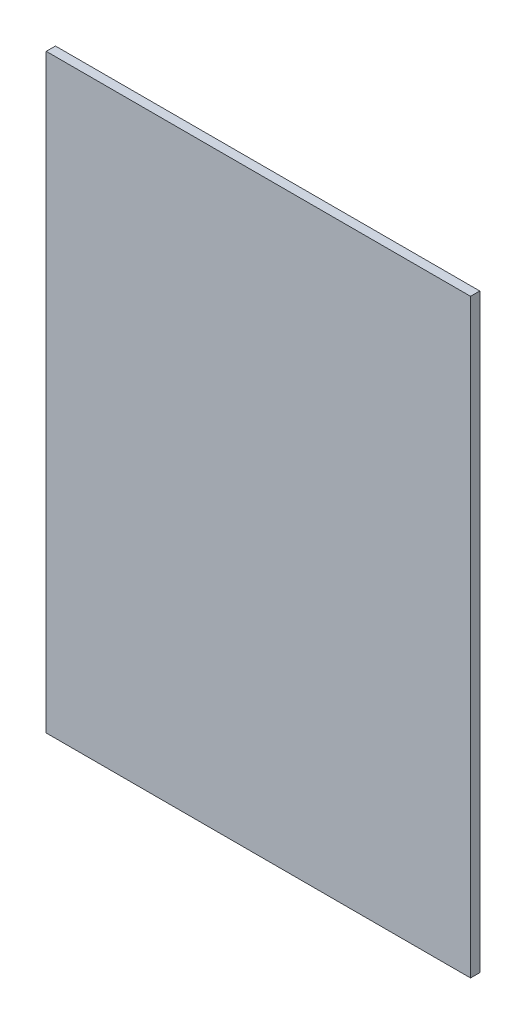
ISO-10303-21;
HEADER;
FILE_DESCRIPTION(('STEP AP214'),'2;1');
FILE_NAME('part.step','',(''),(''),'','','');
FILE_SCHEMA(('AUTOMOTIVE_DESIGN { 1 0 10303 214 1 1 1 1 }'));
ENDSEC;
DATA;
#1=APPLICATION_CONTEXT('core data for automotive mechanical design processes');
#2=APPLICATION_PROTOCOL_DEFINITION('international standard','automotive_design',2000,#1);
#3=PRODUCT_CONTEXT('',#1,'mechanical');
#4=PRODUCT('Part','Part','',(#3));
#5=PRODUCT_RELATED_PRODUCT_CATEGORY('part','',(#4));
#6=PRODUCT_DEFINITION_FORMATION('','',#4);
#7=PRODUCT_DEFINITION_CONTEXT('part definition',#1,'design');
#8=PRODUCT_DEFINITION('design','',#6,#7);
#9=PRODUCT_DEFINITION_SHAPE('','',#8);
#10=(LENGTH_UNIT() NAMED_UNIT(*) SI_UNIT(.MILLI.,.METRE.));
#11=(NAMED_UNIT(*) PLANE_ANGLE_UNIT() SI_UNIT($,.RADIAN.));
#12=(NAMED_UNIT(*) SI_UNIT($,.STERADIAN.) SOLID_ANGLE_UNIT());
#13=UNCERTAINTY_MEASURE_WITH_UNIT(LENGTH_MEASURE(1.E-05),#10,'distance_accuracy_value','');
#14=(GEOMETRIC_REPRESENTATION_CONTEXT(3) GLOBAL_UNCERTAINTY_ASSIGNED_CONTEXT((#13)) GLOBAL_UNIT_ASSIGNED_CONTEXT((#10,
#11,#12)) REPRESENTATION_CONTEXT('',''));
#15=CARTESIAN_POINT('',(0.,0.,0.));
#16=DIRECTION('',(0.,0.,1.));
#17=DIRECTION('',(1.,0.,0.));
#18=AXIS2_PLACEMENT_3D('',#15,#16,#17);
#19=CARTESIAN_POINT('',(0.,0.,6.35));
#20=DIRECTION('',(1.,0.,0.));
#21=DIRECTION('',(0.,0.,-1.));
#22=AXIS2_PLACEMENT_3D('',#19,#20,#21);
#23=PLANE('',#22);
#24=DIRECTION('',(0.,-1.,0.));
#25=VECTOR('',#24,1.);
#26=CARTESIAN_POINT('',(0.,0.,0.));
#27=LINE('',#26,#25);
#28=CARTESIAN_POINT('',(0.,406.4,0.));
#29=VERTEX_POINT('',#28);
#30=CARTESIAN_POINT('',(0.,0.,0.));
#31=VERTEX_POINT('',#30);
#32=EDGE_CURVE('E107',#29,#31,#27,.T.);
#33=ORIENTED_EDGE('',*,*,#32,.T.);
#34=DIRECTION('',(0.,0.,-1.));
#35=VECTOR('',#34,1.);
#36=CARTESIAN_POINT('',(0.,0.,6.35));
#37=LINE('',#36,#35);
#38=CARTESIAN_POINT('',(0.,0.,6.35));
#39=VERTEX_POINT('',#38);
#40=EDGE_CURVE('E11',#39,#31,#37,.T.);
#41=ORIENTED_EDGE('',*,*,#40,.F.);
#42=DIRECTION('',(0.,-1.,0.));
#43=VECTOR('',#42,1.);
#44=CARTESIAN_POINT('',(0.,0.,6.35));
#45=LINE('',#44,#43);
#46=CARTESIAN_POINT('',(0.,406.4,6.35));
#47=VERTEX_POINT('',#46);
#48=EDGE_CURVE('E91',#47,#39,#45,.T.);
#49=ORIENTED_EDGE('',*,*,#48,.F.);
#50=DIRECTION('',(0.,0.,-1.));
#51=VECTOR('',#50,1.);
#52=CARTESIAN_POINT('',(0.,406.4,6.35));
#53=LINE('',#52,#51);
#54=EDGE_CURVE('E103',#47,#29,#53,.T.);
#55=ORIENTED_EDGE('',*,*,#54,.T.);
#56=EDGE_LOOP('',(#33,#41,#49,#55));
#57=FACE_BOUND('',#56,.T.);
#58=ADVANCED_FACE('F39',(#57),#23,.F.);
#59=CARTESIAN_POINT('',(0.,0.,6.35));
#60=DIRECTION('',(0.,1.,0.));
#61=DIRECTION('',(0.,0.,1.));
#62=AXIS2_PLACEMENT_3D('',#59,#60,#61);
#63=PLANE('',#62);
#64=DIRECTION('',(1.,0.,0.));
#65=VECTOR('',#64,1.);
#66=CARTESIAN_POINT('',(0.,0.,0.));
#67=LINE('',#66,#65);
#68=CARTESIAN_POINT('',(292.1,0.,0.));
#69=VERTEX_POINT('',#68);
#70=EDGE_CURVE('E96',#31,#69,#67,.T.);
#71=ORIENTED_EDGE('',*,*,#70,.T.);
#72=DIRECTION('',(0.,0.,-1.));
#73=VECTOR('',#72,1.);
#74=CARTESIAN_POINT('',(292.1,0.,6.35));
#75=LINE('',#74,#73);
#76=CARTESIAN_POINT('',(292.1,0.,6.35));
#77=VERTEX_POINT('',#76);
#78=EDGE_CURVE('E48',#77,#69,#75,.T.);
#79=ORIENTED_EDGE('',*,*,#78,.F.);
#80=DIRECTION('',(1.,0.,0.));
#81=VECTOR('',#80,1.);
#82=CARTESIAN_POINT('',(0.,0.,6.35));
#83=LINE('',#82,#81);
#84=EDGE_CURVE('E86',#39,#77,#83,.T.);
#85=ORIENTED_EDGE('',*,*,#84,.F.);
#86=ORIENTED_EDGE('',*,*,#40,.T.);
#87=EDGE_LOOP('',(#71,#79,#85,#86));
#88=FACE_BOUND('',#87,.T.);
#89=ADVANCED_FACE('F95',(#88),#63,.F.);
#90=CARTESIAN_POINT('',(292.1,0.,6.35));
#91=DIRECTION('',(-1.,0.,0.));
#92=DIRECTION('',(0.,0.,1.));
#93=AXIS2_PLACEMENT_3D('',#90,#91,#92);
#94=PLANE('',#93);
#95=DIRECTION('',(0.,1.,0.));
#96=VECTOR('',#95,1.);
#97=CARTESIAN_POINT('',(292.1,0.,0.));
#98=LINE('',#97,#96);
#99=CARTESIAN_POINT('',(292.1,406.4,0.));
#100=VERTEX_POINT('',#99);
#101=EDGE_CURVE('E73',#69,#100,#98,.T.);
#102=ORIENTED_EDGE('',*,*,#101,.T.);
#103=DIRECTION('',(0.,0.,-1.));
#104=VECTOR('',#103,1.);
#105=CARTESIAN_POINT('',(292.1,406.4,6.35));
#106=LINE('',#105,#104);
#107=CARTESIAN_POINT('',(292.1,406.4,6.35));
#108=VERTEX_POINT('',#107);
#109=EDGE_CURVE('E98',#108,#100,#106,.T.);
#110=ORIENTED_EDGE('',*,*,#109,.F.);
#111=DIRECTION('',(0.,1.,0.));
#112=VECTOR('',#111,1.);
#113=CARTESIAN_POINT('',(292.1,0.,6.35));
#114=LINE('',#113,#112);
#115=EDGE_CURVE('E89',#77,#108,#114,.T.);
#116=ORIENTED_EDGE('',*,*,#115,.F.);
#117=ORIENTED_EDGE('',*,*,#78,.T.);
#118=EDGE_LOOP('',(#102,#110,#116,#117));
#119=FACE_BOUND('',#118,.T.);
#120=ADVANCED_FACE('F99',(#119),#94,.F.);
#121=CARTESIAN_POINT('',(0.,406.4,6.35));
#122=DIRECTION('',(0.,-1.,0.));
#123=DIRECTION('',(0.,0.,-1.));
#124=AXIS2_PLACEMENT_3D('',#121,#122,#123);
#125=PLANE('',#124);
#126=DIRECTION('',(-1.,0.,0.));
#127=VECTOR('',#126,1.);
#128=CARTESIAN_POINT('',(0.,406.4,0.));
#129=LINE('',#128,#127);
#130=EDGE_CURVE('E79',#100,#29,#129,.T.);
#131=ORIENTED_EDGE('',*,*,#130,.T.);
#132=ORIENTED_EDGE('',*,*,#54,.F.);
#133=DIRECTION('',(-1.,0.,0.));
#134=VECTOR('',#133,1.);
#135=CARTESIAN_POINT('',(0.,406.4,6.35));
#136=LINE('',#135,#134);
#137=EDGE_CURVE('E56',#108,#47,#136,.T.);
#138=ORIENTED_EDGE('',*,*,#137,.F.);
#139=ORIENTED_EDGE('',*,*,#109,.T.);
#140=EDGE_LOOP('',(#131,#132,#138,#139));
#141=FACE_BOUND('',#140,.T.);
#142=ADVANCED_FACE('F120',(#141),#125,.F.);
#143=CARTESIAN_POINT('',(0.,0.,6.35));
#144=DIRECTION('',(0.,0.,-1.));
#145=DIRECTION('',(-1.,0.,0.));
#146=AXIS2_PLACEMENT_3D('',#143,#144,#145);
#147=PLANE('',#146);
#148=ORIENTED_EDGE('',*,*,#48,.T.);
#149=ORIENTED_EDGE('',*,*,#84,.T.);
#150=ORIENTED_EDGE('',*,*,#115,.T.);
#151=ORIENTED_EDGE('',*,*,#137,.T.);
#152=EDGE_LOOP('',(#148,#149,#150,#151));
#153=FACE_BOUND('',#152,.T.);
#154=ADVANCED_FACE('F87',(#153),#147,.F.);
#155=CARTESIAN_POINT('',(0.,0.,0.));
#156=DIRECTION('',(0.,0.,-1.));
#157=DIRECTION('',(-1.,0.,0.));
#158=AXIS2_PLACEMENT_3D('',#155,#156,#157);
#159=PLANE('',#158);
#160=ORIENTED_EDGE('',*,*,#32,.F.);
#161=ORIENTED_EDGE('',*,*,#130,.F.);
#162=ORIENTED_EDGE('',*,*,#101,.F.);
#163=ORIENTED_EDGE('',*,*,#70,.F.);
#164=EDGE_LOOP('',(#160,#161,#162,#163));
#165=FACE_BOUND('',#164,.T.);
#166=ADVANCED_FACE('F123',(#165),#159,.T.);
#167=CLOSED_SHELL('',(#58,#89,#120,#142,#154,#166));
#168=MANIFOLD_SOLID_BREP('B2',#167);
#169=ADVANCED_BREP_SHAPE_REPRESENTATION('',(#18,#168),#14);
#170=SHAPE_DEFINITION_REPRESENTATION(#9,#169);
ENDSEC;
END-ISO-10303-21;
